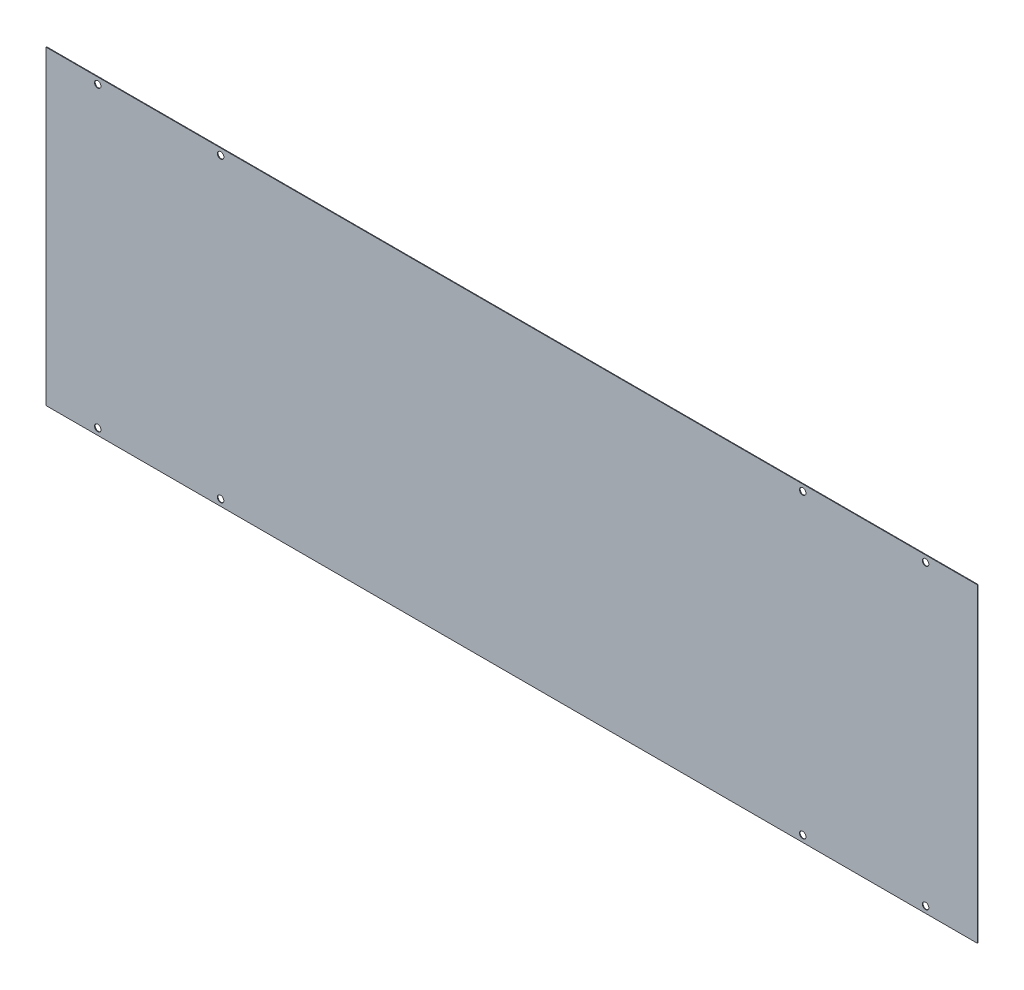
ISO-10303-21;
HEADER;
FILE_DESCRIPTION(('STEP AP214'),'2;1');
FILE_NAME('part.step','',(''),(''),'','','');
FILE_SCHEMA(('AUTOMOTIVE_DESIGN { 1 0 10303 214 1 1 1 1 }'));
ENDSEC;
DATA;
#1=APPLICATION_CONTEXT('core data for automotive mechanical design processes');
#2=APPLICATION_PROTOCOL_DEFINITION('international standard','automotive_design',2000,#1);
#3=PRODUCT_CONTEXT('',#1,'mechanical');
#4=PRODUCT('Part','Part','',(#3));
#5=PRODUCT_RELATED_PRODUCT_CATEGORY('part','',(#4));
#6=PRODUCT_DEFINITION_FORMATION('','',#4);
#7=PRODUCT_DEFINITION_CONTEXT('part definition',#1,'design');
#8=PRODUCT_DEFINITION('design','',#6,#7);
#9=PRODUCT_DEFINITION_SHAPE('','',#8);
#10=(LENGTH_UNIT() NAMED_UNIT(*) SI_UNIT(.MILLI.,.METRE.));
#11=(NAMED_UNIT(*) PLANE_ANGLE_UNIT() SI_UNIT($,.RADIAN.));
#12=(NAMED_UNIT(*) SI_UNIT($,.STERADIAN.) SOLID_ANGLE_UNIT());
#13=UNCERTAINTY_MEASURE_WITH_UNIT(LENGTH_MEASURE(1.E-05),#10,'distance_accuracy_value','');
#14=(GEOMETRIC_REPRESENTATION_CONTEXT(3) GLOBAL_UNCERTAINTY_ASSIGNED_CONTEXT((#13)) GLOBAL_UNIT_ASSIGNED_CONTEXT((#10,
#11,#12)) REPRESENTATION_CONTEXT('',''));
#15=CARTESIAN_POINT('',(0.,0.,0.));
#16=DIRECTION('',(0.,0.,1.));
#17=DIRECTION('',(1.,0.,0.));
#18=AXIS2_PLACEMENT_3D('',#15,#16,#17);
#19=CARTESIAN_POINT('',(0.,0.,0.635));
#20=DIRECTION('',(0.,0.,-1.));
#21=DIRECTION('',(-1.,0.,0.));
#22=AXIS2_PLACEMENT_3D('',#19,#20,#21);
#23=PLANE('',#22);
#24=CARTESIAN_POINT('',(-406.4,146.05,0.635000000000001));
#25=DIRECTION('',(0.,0.,1.));
#26=DIRECTION('',(1.,0.,0.));
#27=AXIS2_PLACEMENT_3D('',#24,#25,#26);
#28=CIRCLE('',#27,3.17499999999998);
#29=CARTESIAN_POINT('',(-403.225,146.05,0.635000000000001));
#30=VERTEX_POINT('',#29);
#31=EDGE_CURVE('E154',#30,#30,#28,.T.);
#32=ORIENTED_EDGE('',*,*,#31,.F.);
#33=EDGE_LOOP('',(#32));
#34=FACE_BOUND('',#33,.T.);
#35=CARTESIAN_POINT('',(-406.4,-146.05,0.635000000000001));
#36=DIRECTION('',(0.,0.,1.));
#37=DIRECTION('',(1.,0.,0.));
#38=AXIS2_PLACEMENT_3D('',#35,#36,#37);
#39=CIRCLE('',#38,3.17499999999998);
#40=CARTESIAN_POINT('',(-403.225,-146.05,0.635000000000001));
#41=VERTEX_POINT('',#40);
#42=EDGE_CURVE('E148',#41,#41,#39,.T.);
#43=ORIENTED_EDGE('',*,*,#42,.F.);
#44=EDGE_LOOP('',(#43));
#45=FACE_BOUND('',#44,.T.);
#46=CARTESIAN_POINT('',(-285.75,-146.05,0.635000000000001));
#47=DIRECTION('',(0.,0.,1.));
#48=DIRECTION('',(1.,0.,0.));
#49=AXIS2_PLACEMENT_3D('',#46,#47,#48);
#50=CIRCLE('',#49,3.17499999999998);
#51=CARTESIAN_POINT('',(-282.575,-146.05,0.635000000000001));
#52=VERTEX_POINT('',#51);
#53=EDGE_CURVE('E142',#52,#52,#50,.T.);
#54=ORIENTED_EDGE('',*,*,#53,.F.);
#55=EDGE_LOOP('',(#54));
#56=FACE_BOUND('',#55,.T.);
#57=CARTESIAN_POINT('',(285.75,146.05,0.635000000000001));
#58=DIRECTION('',(0.,0.,1.));
#59=DIRECTION('',(1.,0.,0.));
#60=AXIS2_PLACEMENT_3D('',#57,#58,#59);
#61=CIRCLE('',#60,3.17499999999998);
#62=CARTESIAN_POINT('',(288.925,146.05,0.635000000000001));
#63=VERTEX_POINT('',#62);
#64=EDGE_CURVE('E136',#63,#63,#61,.T.);
#65=ORIENTED_EDGE('',*,*,#64,.F.);
#66=EDGE_LOOP('',(#65));
#67=FACE_BOUND('',#66,.T.);
#68=CARTESIAN_POINT('',(406.4,146.05,0.635000000000001));
#69=DIRECTION('',(0.,0.,1.));
#70=DIRECTION('',(1.,0.,0.));
#71=AXIS2_PLACEMENT_3D('',#68,#69,#70);
#72=CIRCLE('',#71,3.17499999999998);
#73=CARTESIAN_POINT('',(409.575,146.05,0.635000000000001));
#74=VERTEX_POINT('',#73);
#75=EDGE_CURVE('E130',#74,#74,#72,.T.);
#76=ORIENTED_EDGE('',*,*,#75,.F.);
#77=EDGE_LOOP('',(#76));
#78=FACE_BOUND('',#77,.T.);
#79=CARTESIAN_POINT('',(406.4,-146.05,0.635000000000001));
#80=DIRECTION('',(0.,0.,1.));
#81=DIRECTION('',(1.,0.,0.));
#82=AXIS2_PLACEMENT_3D('',#79,#80,#81);
#83=CIRCLE('',#82,3.17499999999998);
#84=CARTESIAN_POINT('',(409.575,-146.05,0.635000000000001));
#85=VERTEX_POINT('',#84);
#86=EDGE_CURVE('E124',#85,#85,#83,.T.);
#87=ORIENTED_EDGE('',*,*,#86,.F.);
#88=EDGE_LOOP('',(#87));
#89=FACE_BOUND('',#88,.T.);
#90=CARTESIAN_POINT('',(285.75,-146.05,0.635000000000001));
#91=DIRECTION('',(0.,0.,1.));
#92=DIRECTION('',(1.,0.,0.));
#93=AXIS2_PLACEMENT_3D('',#90,#91,#92);
#94=CIRCLE('',#93,3.17499999999998);
#95=CARTESIAN_POINT('',(288.925,-146.05,0.635000000000001));
#96=VERTEX_POINT('',#95);
#97=EDGE_CURVE('E118',#96,#96,#94,.T.);
#98=ORIENTED_EDGE('',*,*,#97,.F.);
#99=EDGE_LOOP('',(#98));
#100=FACE_BOUND('',#99,.T.);
#101=DIRECTION('',(0.,1.,0.));
#102=VECTOR('',#101,1.);
#103=CARTESIAN_POINT('',(457.2,-152.4,0.635));
#104=LINE('',#103,#102);
#105=CARTESIAN_POINT('',(457.2,-152.4,0.635));
#106=VERTEX_POINT('',#105);
#107=CARTESIAN_POINT('',(457.2,152.4,0.635));
#108=VERTEX_POINT('',#107);
#109=EDGE_CURVE('E89',#106,#108,#104,.T.);
#110=ORIENTED_EDGE('',*,*,#109,.T.);
#111=DIRECTION('',(-1.,0.,0.));
#112=VECTOR('',#111,1.);
#113=CARTESIAN_POINT('',(-457.2,152.4,0.635));
#114=LINE('',#113,#112);
#115=CARTESIAN_POINT('',(-457.2,152.4,0.635));
#116=VERTEX_POINT('',#115);
#117=EDGE_CURVE('E84',#108,#116,#114,.T.);
#118=ORIENTED_EDGE('',*,*,#117,.T.);
#119=DIRECTION('',(0.,-1.,0.));
#120=VECTOR('',#119,1.);
#121=CARTESIAN_POINT('',(-457.2,-152.4,0.635));
#122=LINE('',#121,#120);
#123=CARTESIAN_POINT('',(-457.2,-152.4,0.635));
#124=VERTEX_POINT('',#123);
#125=EDGE_CURVE('E87',#116,#124,#122,.T.);
#126=ORIENTED_EDGE('',*,*,#125,.T.);
#127=DIRECTION('',(1.,0.,0.));
#128=VECTOR('',#127,1.);
#129=CARTESIAN_POINT('',(-457.2,-152.4,0.635));
#130=LINE('',#129,#128);
#131=EDGE_CURVE('E54',#124,#106,#130,.T.);
#132=ORIENTED_EDGE('',*,*,#131,.T.);
#133=EDGE_LOOP('',(#110,#118,#126,#132));
#134=FACE_BOUND('',#133,.T.);
#135=CARTESIAN_POINT('',(-285.75,146.05,0.635000000000001));
#136=DIRECTION('',(0.,0.,1.));
#137=DIRECTION('',(1.,0.,0.));
#138=AXIS2_PLACEMENT_3D('',#135,#136,#137);
#139=CIRCLE('',#138,3.17499999999998);
#140=CARTESIAN_POINT('',(-282.575,146.05,0.635000000000001));
#141=VERTEX_POINT('',#140);
#142=EDGE_CURVE('E160',#141,#141,#139,.T.);
#143=ORIENTED_EDGE('',*,*,#142,.F.);
#144=EDGE_LOOP('',(#143));
#145=FACE_BOUND('',#144,.T.);
#146=ADVANCED_FACE('F37',(#34,#45,#56,#67,#78,#89,#100,#134,#145),#23,.F.);
#147=CARTESIAN_POINT('',(0.,0.,0.));
#148=DIRECTION('',(0.,0.,-1.));
#149=DIRECTION('',(-1.,0.,0.));
#150=AXIS2_PLACEMENT_3D('',#147,#148,#149);
#151=PLANE('',#150);
#152=CARTESIAN_POINT('',(-285.75,146.05,0.));
#153=DIRECTION('',(0.,0.,1.));
#154=DIRECTION('',(1.,0.,0.));
#155=AXIS2_PLACEMENT_3D('',#152,#153,#154);
#156=CIRCLE('',#155,3.17499999999998);
#157=CARTESIAN_POINT('',(-282.575,146.05,0.));
#158=VERTEX_POINT('',#157);
#159=EDGE_CURVE('E157',#158,#158,#156,.T.);
#160=ORIENTED_EDGE('',*,*,#159,.T.);
#161=EDGE_LOOP('',(#160));
#162=FACE_BOUND('',#161,.T.);
#163=DIRECTION('',(0.,1.,0.));
#164=VECTOR('',#163,1.);
#165=CARTESIAN_POINT('',(457.2,-152.4,0.));
#166=LINE('',#165,#164);
#167=CARTESIAN_POINT('',(457.2,-152.4,0.));
#168=VERTEX_POINT('',#167);
#169=CARTESIAN_POINT('',(457.2,152.4,0.));
#170=VERTEX_POINT('',#169);
#171=EDGE_CURVE('E101',#168,#170,#166,.T.);
#172=ORIENTED_EDGE('',*,*,#171,.F.);
#173=DIRECTION('',(1.,0.,0.));
#174=VECTOR('',#173,1.);
#175=CARTESIAN_POINT('',(-457.2,-152.4,0.));
#176=LINE('',#175,#174);
#177=CARTESIAN_POINT('',(-457.2,-152.4,0.));
#178=VERTEX_POINT('',#177);
#179=EDGE_CURVE('E77',#178,#168,#176,.T.);
#180=ORIENTED_EDGE('',*,*,#179,.F.);
#181=DIRECTION('',(0.,-1.,0.));
#182=VECTOR('',#181,1.);
#183=CARTESIAN_POINT('',(-457.2,-152.4,0.));
#184=LINE('',#183,#182);
#185=CARTESIAN_POINT('',(-457.2,152.4,0.));
#186=VERTEX_POINT('',#185);
#187=EDGE_CURVE('E71',#186,#178,#184,.T.);
#188=ORIENTED_EDGE('',*,*,#187,.F.);
#189=DIRECTION('',(-1.,0.,0.));
#190=VECTOR('',#189,1.);
#191=CARTESIAN_POINT('',(-457.2,152.4,0.));
#192=LINE('',#191,#190);
#193=EDGE_CURVE('E93',#170,#186,#192,.T.);
#194=ORIENTED_EDGE('',*,*,#193,.F.);
#195=EDGE_LOOP('',(#172,#180,#188,#194));
#196=FACE_BOUND('',#195,.T.);
#197=CARTESIAN_POINT('',(285.75,-146.05,0.));
#198=DIRECTION('',(0.,0.,1.));
#199=DIRECTION('',(1.,0.,0.));
#200=AXIS2_PLACEMENT_3D('',#197,#198,#199);
#201=CIRCLE('',#200,3.17499999999998);
#202=CARTESIAN_POINT('',(288.925,-146.05,0.));
#203=VERTEX_POINT('',#202);
#204=EDGE_CURVE('E104',#203,#203,#201,.T.);
#205=ORIENTED_EDGE('',*,*,#204,.T.);
#206=EDGE_LOOP('',(#205));
#207=FACE_BOUND('',#206,.T.);
#208=CARTESIAN_POINT('',(406.4,-146.05,0.));
#209=DIRECTION('',(0.,0.,1.));
#210=DIRECTION('',(1.,0.,0.));
#211=AXIS2_PLACEMENT_3D('',#208,#209,#210);
#212=CIRCLE('',#211,3.17499999999998);
#213=CARTESIAN_POINT('',(409.575,-146.05,0.));
#214=VERTEX_POINT('',#213);
#215=EDGE_CURVE('E121',#214,#214,#212,.T.);
#216=ORIENTED_EDGE('',*,*,#215,.T.);
#217=EDGE_LOOP('',(#216));
#218=FACE_BOUND('',#217,.T.);
#219=CARTESIAN_POINT('',(406.4,146.05,0.));
#220=DIRECTION('',(0.,0.,1.));
#221=DIRECTION('',(1.,0.,0.));
#222=AXIS2_PLACEMENT_3D('',#219,#220,#221);
#223=CIRCLE('',#222,3.17499999999998);
#224=CARTESIAN_POINT('',(409.575,146.05,0.));
#225=VERTEX_POINT('',#224);
#226=EDGE_CURVE('E127',#225,#225,#223,.T.);
#227=ORIENTED_EDGE('',*,*,#226,.T.);
#228=EDGE_LOOP('',(#227));
#229=FACE_BOUND('',#228,.T.);
#230=CARTESIAN_POINT('',(285.75,146.05,0.));
#231=DIRECTION('',(0.,0.,1.));
#232=DIRECTION('',(1.,0.,0.));
#233=AXIS2_PLACEMENT_3D('',#230,#231,#232);
#234=CIRCLE('',#233,3.17499999999998);
#235=CARTESIAN_POINT('',(288.925,146.05,0.));
#236=VERTEX_POINT('',#235);
#237=EDGE_CURVE('E133',#236,#236,#234,.T.);
#238=ORIENTED_EDGE('',*,*,#237,.T.);
#239=EDGE_LOOP('',(#238));
#240=FACE_BOUND('',#239,.T.);
#241=CARTESIAN_POINT('',(-285.75,-146.05,0.));
#242=DIRECTION('',(0.,0.,1.));
#243=DIRECTION('',(1.,0.,0.));
#244=AXIS2_PLACEMENT_3D('',#241,#242,#243);
#245=CIRCLE('',#244,3.17499999999998);
#246=CARTESIAN_POINT('',(-282.575,-146.05,0.));
#247=VERTEX_POINT('',#246);
#248=EDGE_CURVE('E139',#247,#247,#245,.T.);
#249=ORIENTED_EDGE('',*,*,#248,.T.);
#250=EDGE_LOOP('',(#249));
#251=FACE_BOUND('',#250,.T.);
#252=CARTESIAN_POINT('',(-406.4,-146.05,0.));
#253=DIRECTION('',(0.,0.,1.));
#254=DIRECTION('',(1.,0.,0.));
#255=AXIS2_PLACEMENT_3D('',#252,#253,#254);
#256=CIRCLE('',#255,3.17499999999998);
#257=CARTESIAN_POINT('',(-403.225,-146.05,0.));
#258=VERTEX_POINT('',#257);
#259=EDGE_CURVE('E145',#258,#258,#256,.T.);
#260=ORIENTED_EDGE('',*,*,#259,.T.);
#261=EDGE_LOOP('',(#260));
#262=FACE_BOUND('',#261,.T.);
#263=CARTESIAN_POINT('',(-406.4,146.05,0.));
#264=DIRECTION('',(0.,0.,1.));
#265=DIRECTION('',(1.,0.,0.));
#266=AXIS2_PLACEMENT_3D('',#263,#264,#265);
#267=CIRCLE('',#266,3.17499999999998);
#268=CARTESIAN_POINT('',(-403.225,146.05,0.));
#269=VERTEX_POINT('',#268);
#270=EDGE_CURVE('E151',#269,#269,#267,.T.);
#271=ORIENTED_EDGE('',*,*,#270,.T.);
#272=EDGE_LOOP('',(#271));
#273=FACE_BOUND('',#272,.T.);
#274=ADVANCED_FACE('F112',(#162,#196,#207,#218,#229,#240,#251,#262,#273),#151,.T.);
#275=CARTESIAN_POINT('',(457.2,-152.4,0.635));
#276=DIRECTION('',(-1.,0.,0.));
#277=DIRECTION('',(0.,0.,1.));
#278=AXIS2_PLACEMENT_3D('',#275,#276,#277);
#279=PLANE('',#278);
#280=ORIENTED_EDGE('',*,*,#171,.T.);
#281=DIRECTION('',(0.,0.,-1.));
#282=VECTOR('',#281,1.);
#283=CARTESIAN_POINT('',(457.2,152.4,0.635));
#284=LINE('',#283,#282);
#285=EDGE_CURVE('E11',#108,#170,#284,.T.);
#286=ORIENTED_EDGE('',*,*,#285,.F.);
#287=ORIENTED_EDGE('',*,*,#109,.F.);
#288=DIRECTION('',(0.,0.,-1.));
#289=VECTOR('',#288,1.);
#290=CARTESIAN_POINT('',(457.2,-152.4,0.635));
#291=LINE('',#290,#289);
#292=EDGE_CURVE('E97',#106,#168,#291,.T.);
#293=ORIENTED_EDGE('',*,*,#292,.T.);
#294=EDGE_LOOP('',(#280,#286,#287,#293));
#295=FACE_BOUND('',#294,.T.);
#296=ADVANCED_FACE('F39',(#295),#279,.F.);
#297=CARTESIAN_POINT('',(-457.2,152.4,0.635));
#298=DIRECTION('',(0.,-1.,0.));
#299=DIRECTION('',(0.,0.,-1.));
#300=AXIS2_PLACEMENT_3D('',#297,#298,#299);
#301=PLANE('',#300);
#302=ORIENTED_EDGE('',*,*,#193,.T.);
#303=DIRECTION('',(0.,0.,-1.));
#304=VECTOR('',#303,1.);
#305=CARTESIAN_POINT('',(-457.2,152.4,0.635));
#306=LINE('',#305,#304);
#307=EDGE_CURVE('E46',#116,#186,#306,.T.);
#308=ORIENTED_EDGE('',*,*,#307,.F.);
#309=ORIENTED_EDGE('',*,*,#117,.F.);
#310=ORIENTED_EDGE('',*,*,#285,.T.);
#311=EDGE_LOOP('',(#302,#308,#309,#310));
#312=FACE_BOUND('',#311,.T.);
#313=ADVANCED_FACE('F92',(#312),#301,.F.);
#314=CARTESIAN_POINT('',(-457.2,-152.4,0.635));
#315=DIRECTION('',(1.,0.,0.));
#316=DIRECTION('',(0.,0.,-1.));
#317=AXIS2_PLACEMENT_3D('',#314,#315,#316);
#318=PLANE('',#317);
#319=ORIENTED_EDGE('',*,*,#187,.T.);
#320=DIRECTION('',(0.,0.,-1.));
#321=VECTOR('',#320,1.);
#322=CARTESIAN_POINT('',(-457.2,-152.4,0.635));
#323=LINE('',#322,#321);
#324=EDGE_CURVE('E94',#124,#178,#323,.T.);
#325=ORIENTED_EDGE('',*,*,#324,.F.);
#326=ORIENTED_EDGE('',*,*,#125,.F.);
#327=ORIENTED_EDGE('',*,*,#307,.T.);
#328=EDGE_LOOP('',(#319,#325,#326,#327));
#329=FACE_BOUND('',#328,.T.);
#330=ADVANCED_FACE('F95',(#329),#318,.F.);
#331=CARTESIAN_POINT('',(-457.2,-152.4,0.635));
#332=DIRECTION('',(0.,1.,0.));
#333=DIRECTION('',(0.,0.,1.));
#334=AXIS2_PLACEMENT_3D('',#331,#332,#333);
#335=PLANE('',#334);
#336=ORIENTED_EDGE('',*,*,#179,.T.);
#337=ORIENTED_EDGE('',*,*,#292,.F.);
#338=ORIENTED_EDGE('',*,*,#131,.F.);
#339=ORIENTED_EDGE('',*,*,#324,.T.);
#340=EDGE_LOOP('',(#336,#337,#338,#339));
#341=FACE_BOUND('',#340,.T.);
#342=ADVANCED_FACE('F109',(#341),#335,.F.);
#343=CARTESIAN_POINT('',(285.75,-146.05,0.635));
#344=DIRECTION('',(0.,0.,1.));
#345=DIRECTION('',(1.,0.,0.));
#346=AXIS2_PLACEMENT_3D('',#343,#344,#345);
#347=CYLINDRICAL_SURFACE('',#346,3.17499999999998);
#348=ORIENTED_EDGE('',*,*,#204,.F.);
#349=EDGE_LOOP('',(#348));
#350=FACE_BOUND('',#349,.T.);
#351=ORIENTED_EDGE('',*,*,#97,.T.);
#352=EDGE_LOOP('',(#351));
#353=FACE_BOUND('',#352,.T.);
#354=ADVANCED_FACE('F177',(#350,#353),#347,.F.);
#355=CARTESIAN_POINT('',(406.4,-146.05,0.635));
#356=DIRECTION('',(0.,0.,1.));
#357=DIRECTION('',(1.,0.,0.));
#358=AXIS2_PLACEMENT_3D('',#355,#356,#357);
#359=CYLINDRICAL_SURFACE('',#358,3.17499999999998);
#360=ORIENTED_EDGE('',*,*,#215,.F.);
#361=EDGE_LOOP('',(#360));
#362=FACE_BOUND('',#361,.T.);
#363=ORIENTED_EDGE('',*,*,#86,.T.);
#364=EDGE_LOOP('',(#363));
#365=FACE_BOUND('',#364,.T.);
#366=ADVANCED_FACE('F206',(#362,#365),#359,.F.);
#367=CARTESIAN_POINT('',(406.4,146.05,0.635));
#368=DIRECTION('',(0.,0.,1.));
#369=DIRECTION('',(1.,0.,0.));
#370=AXIS2_PLACEMENT_3D('',#367,#368,#369);
#371=CYLINDRICAL_SURFACE('',#370,3.17499999999998);
#372=ORIENTED_EDGE('',*,*,#226,.F.);
#373=EDGE_LOOP('',(#372));
#374=FACE_BOUND('',#373,.T.);
#375=ORIENTED_EDGE('',*,*,#75,.T.);
#376=EDGE_LOOP('',(#375));
#377=FACE_BOUND('',#376,.T.);
#378=ADVANCED_FACE('F213',(#374,#377),#371,.F.);
#379=CARTESIAN_POINT('',(285.75,146.05,0.635));
#380=DIRECTION('',(0.,0.,1.));
#381=DIRECTION('',(1.,0.,0.));
#382=AXIS2_PLACEMENT_3D('',#379,#380,#381);
#383=CYLINDRICAL_SURFACE('',#382,3.17499999999998);
#384=ORIENTED_EDGE('',*,*,#237,.F.);
#385=EDGE_LOOP('',(#384));
#386=FACE_BOUND('',#385,.T.);
#387=ORIENTED_EDGE('',*,*,#64,.T.);
#388=EDGE_LOOP('',(#387));
#389=FACE_BOUND('',#388,.T.);
#390=ADVANCED_FACE('F220',(#386,#389),#383,.F.);
#391=CARTESIAN_POINT('',(-285.75,-146.05,0.635));
#392=DIRECTION('',(0.,0.,1.));
#393=DIRECTION('',(1.,0.,0.));
#394=AXIS2_PLACEMENT_3D('',#391,#392,#393);
#395=CYLINDRICAL_SURFACE('',#394,3.17499999999998);
#396=ORIENTED_EDGE('',*,*,#248,.F.);
#397=EDGE_LOOP('',(#396));
#398=FACE_BOUND('',#397,.T.);
#399=ORIENTED_EDGE('',*,*,#53,.T.);
#400=EDGE_LOOP('',(#399));
#401=FACE_BOUND('',#400,.T.);
#402=ADVANCED_FACE('F227',(#398,#401),#395,.F.);
#403=CARTESIAN_POINT('',(-406.4,-146.05,0.635));
#404=DIRECTION('',(0.,0.,1.));
#405=DIRECTION('',(1.,0.,0.));
#406=AXIS2_PLACEMENT_3D('',#403,#404,#405);
#407=CYLINDRICAL_SURFACE('',#406,3.17499999999998);
#408=ORIENTED_EDGE('',*,*,#259,.F.);
#409=EDGE_LOOP('',(#408));
#410=FACE_BOUND('',#409,.T.);
#411=ORIENTED_EDGE('',*,*,#42,.T.);
#412=EDGE_LOOP('',(#411));
#413=FACE_BOUND('',#412,.T.);
#414=ADVANCED_FACE('F241',(#410,#413),#407,.F.);
#415=CARTESIAN_POINT('',(-406.4,146.05,0.635));
#416=DIRECTION('',(0.,0.,1.));
#417=DIRECTION('',(1.,0.,0.));
#418=AXIS2_PLACEMENT_3D('',#415,#416,#417);
#419=CYLINDRICAL_SURFACE('',#418,3.17499999999998);
#420=ORIENTED_EDGE('',*,*,#270,.F.);
#421=EDGE_LOOP('',(#420));
#422=FACE_BOUND('',#421,.T.);
#423=ORIENTED_EDGE('',*,*,#31,.T.);
#424=EDGE_LOOP('',(#423));
#425=FACE_BOUND('',#424,.T.);
#426=ADVANCED_FACE('F249',(#422,#425),#419,.F.);
#427=CARTESIAN_POINT('',(-285.75,146.05,0.635));
#428=DIRECTION('',(0.,0.,1.));
#429=DIRECTION('',(1.,0.,0.));
#430=AXIS2_PLACEMENT_3D('',#427,#428,#429);
#431=CYLINDRICAL_SURFACE('',#430,3.17499999999998);
#432=ORIENTED_EDGE('',*,*,#159,.F.);
#433=EDGE_LOOP('',(#432));
#434=FACE_BOUND('',#433,.T.);
#435=ORIENTED_EDGE('',*,*,#142,.T.);
#436=EDGE_LOOP('',(#435));
#437=FACE_BOUND('',#436,.T.);
#438=ADVANCED_FACE('F164',(#434,#437),#431,.F.);
#439=CLOSED_SHELL('',(#146,#274,#296,#313,#330,#342,#354,#366,#378,#390,#402,#414,#426,#438));
#440=MANIFOLD_SOLID_BREP('B2',#439);
#441=ADVANCED_BREP_SHAPE_REPRESENTATION('',(#18,#440),#14);
#442=SHAPE_DEFINITION_REPRESENTATION(#9,#441);
ENDSEC;
END-ISO-10303-21;
